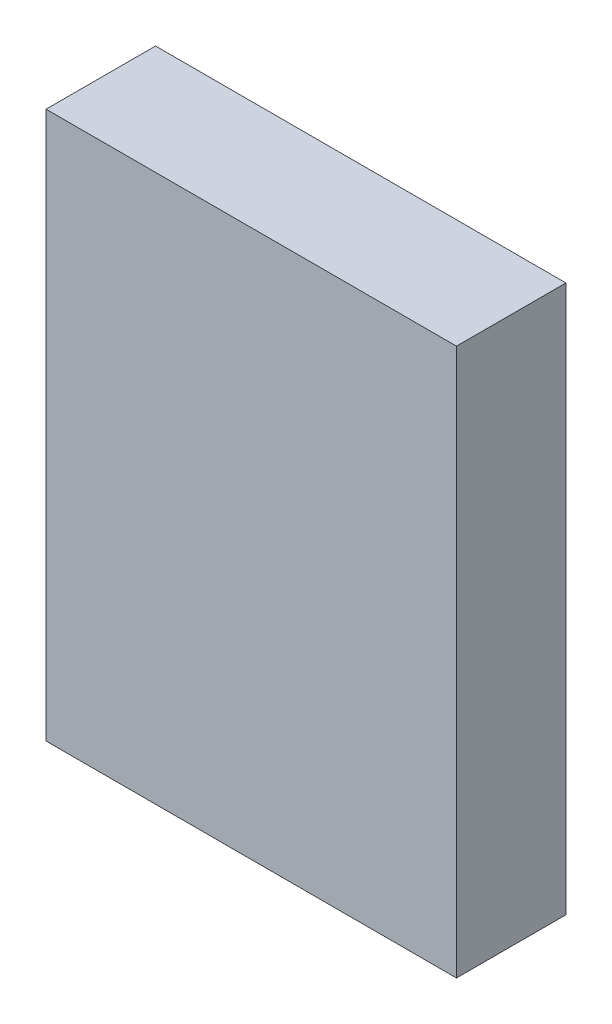
ISO-10303-21;
HEADER;
FILE_DESCRIPTION(('STEP AP214'),'2;1');
FILE_NAME('part.step','',(''),(''),'','','');
FILE_SCHEMA(('AUTOMOTIVE_DESIGN { 1 0 10303 214 1 1 1 1 }'));
ENDSEC;
DATA;
#1=APPLICATION_CONTEXT('core data for automotive mechanical design processes');
#2=APPLICATION_PROTOCOL_DEFINITION('international standard','automotive_design',2000,#1);
#3=PRODUCT_CONTEXT('',#1,'mechanical');
#4=PRODUCT('Part','Part','',(#3));
#5=PRODUCT_RELATED_PRODUCT_CATEGORY('part','',(#4));
#6=PRODUCT_DEFINITION_FORMATION('','',#4);
#7=PRODUCT_DEFINITION_CONTEXT('part definition',#1,'design');
#8=PRODUCT_DEFINITION('design','',#6,#7);
#9=PRODUCT_DEFINITION_SHAPE('','',#8);
#10=(LENGTH_UNIT() NAMED_UNIT(*) SI_UNIT(.MILLI.,.METRE.));
#11=(NAMED_UNIT(*) PLANE_ANGLE_UNIT() SI_UNIT($,.RADIAN.));
#12=(NAMED_UNIT(*) SI_UNIT($,.STERADIAN.) SOLID_ANGLE_UNIT());
#13=UNCERTAINTY_MEASURE_WITH_UNIT(LENGTH_MEASURE(1.E-05),#10,'distance_accuracy_value','');
#14=(GEOMETRIC_REPRESENTATION_CONTEXT(3) GLOBAL_UNCERTAINTY_ASSIGNED_CONTEXT((#13)) GLOBAL_UNIT_ASSIGNED_CONTEXT((#10,
#11,#12)) REPRESENTATION_CONTEXT('',''));
#15=CARTESIAN_POINT('',(0.,0.,0.));
#16=DIRECTION('',(0.,0.,1.));
#17=DIRECTION('',(1.,0.,0.));
#18=AXIS2_PLACEMENT_3D('',#15,#16,#17);
#19=CARTESIAN_POINT('',(0.,0.,6.));
#20=DIRECTION('',(1.,0.,0.));
#21=DIRECTION('',(0.,0.,-1.));
#22=AXIS2_PLACEMENT_3D('',#19,#20,#21);
#23=PLANE('',#22);
#24=DIRECTION('',(0.,-1.,0.));
#25=VECTOR('',#24,1.);
#26=CARTESIAN_POINT('',(0.,0.,0.));
#27=LINE('',#26,#25);
#28=CARTESIAN_POINT('',(0.,30.,0.));
#29=VERTEX_POINT('',#28);
#30=CARTESIAN_POINT('',(0.,0.,0.));
#31=VERTEX_POINT('',#30);
#32=EDGE_CURVE('E107',#29,#31,#27,.T.);
#33=ORIENTED_EDGE('',*,*,#32,.T.);
#34=DIRECTION('',(0.,0.,-1.));
#35=VECTOR('',#34,1.);
#36=CARTESIAN_POINT('',(0.,0.,6.));
#37=LINE('',#36,#35);
#38=CARTESIAN_POINT('',(0.,0.,6.));
#39=VERTEX_POINT('',#38);
#40=EDGE_CURVE('E11',#39,#31,#37,.T.);
#41=ORIENTED_EDGE('',*,*,#40,.F.);
#42=DIRECTION('',(0.,-1.,0.));
#43=VECTOR('',#42,1.);
#44=CARTESIAN_POINT('',(0.,0.,6.));
#45=LINE('',#44,#43);
#46=CARTESIAN_POINT('',(0.,30.,6.));
#47=VERTEX_POINT('',#46);
#48=EDGE_CURVE('E91',#47,#39,#45,.T.);
#49=ORIENTED_EDGE('',*,*,#48,.F.);
#50=DIRECTION('',(0.,0.,-1.));
#51=VECTOR('',#50,1.);
#52=CARTESIAN_POINT('',(0.,30.,6.));
#53=LINE('',#52,#51);
#54=EDGE_CURVE('E103',#47,#29,#53,.T.);
#55=ORIENTED_EDGE('',*,*,#54,.T.);
#56=EDGE_LOOP('',(#33,#41,#49,#55));
#57=FACE_BOUND('',#56,.T.);
#58=ADVANCED_FACE('F39',(#57),#23,.F.);
#59=CARTESIAN_POINT('',(0.,0.,6.));
#60=DIRECTION('',(0.,1.,0.));
#61=DIRECTION('',(0.,0.,1.));
#62=AXIS2_PLACEMENT_3D('',#59,#60,#61);
#63=PLANE('',#62);
#64=DIRECTION('',(1.,0.,0.));
#65=VECTOR('',#64,1.);
#66=CARTESIAN_POINT('',(0.,0.,0.));
#67=LINE('',#66,#65);
#68=CARTESIAN_POINT('',(22.5,0.,0.));
#69=VERTEX_POINT('',#68);
#70=EDGE_CURVE('E96',#31,#69,#67,.T.);
#71=ORIENTED_EDGE('',*,*,#70,.T.);
#72=DIRECTION('',(0.,0.,-1.));
#73=VECTOR('',#72,1.);
#74=CARTESIAN_POINT('',(22.5,0.,6.));
#75=LINE('',#74,#73);
#76=CARTESIAN_POINT('',(22.5,0.,6.));
#77=VERTEX_POINT('',#76);
#78=EDGE_CURVE('E48',#77,#69,#75,.T.);
#79=ORIENTED_EDGE('',*,*,#78,.F.);
#80=DIRECTION('',(1.,0.,0.));
#81=VECTOR('',#80,1.);
#82=CARTESIAN_POINT('',(0.,0.,6.));
#83=LINE('',#82,#81);
#84=EDGE_CURVE('E86',#39,#77,#83,.T.);
#85=ORIENTED_EDGE('',*,*,#84,.F.);
#86=ORIENTED_EDGE('',*,*,#40,.T.);
#87=EDGE_LOOP('',(#71,#79,#85,#86));
#88=FACE_BOUND('',#87,.T.);
#89=ADVANCED_FACE('F95',(#88),#63,.F.);
#90=CARTESIAN_POINT('',(22.5,0.,6.));
#91=DIRECTION('',(-1.,0.,0.));
#92=DIRECTION('',(0.,0.,1.));
#93=AXIS2_PLACEMENT_3D('',#90,#91,#92);
#94=PLANE('',#93);
#95=DIRECTION('',(0.,1.,0.));
#96=VECTOR('',#95,1.);
#97=CARTESIAN_POINT('',(22.5,0.,0.));
#98=LINE('',#97,#96);
#99=CARTESIAN_POINT('',(22.5,30.,0.));
#100=VERTEX_POINT('',#99);
#101=EDGE_CURVE('E73',#69,#100,#98,.T.);
#102=ORIENTED_EDGE('',*,*,#101,.T.);
#103=DIRECTION('',(0.,0.,-1.));
#104=VECTOR('',#103,1.);
#105=CARTESIAN_POINT('',(22.5,30.,6.));
#106=LINE('',#105,#104);
#107=CARTESIAN_POINT('',(22.5,30.,6.));
#108=VERTEX_POINT('',#107);
#109=EDGE_CURVE('E98',#108,#100,#106,.T.);
#110=ORIENTED_EDGE('',*,*,#109,.F.);
#111=DIRECTION('',(0.,1.,0.));
#112=VECTOR('',#111,1.);
#113=CARTESIAN_POINT('',(22.5,0.,6.));
#114=LINE('',#113,#112);
#115=EDGE_CURVE('E89',#77,#108,#114,.T.);
#116=ORIENTED_EDGE('',*,*,#115,.F.);
#117=ORIENTED_EDGE('',*,*,#78,.T.);
#118=EDGE_LOOP('',(#102,#110,#116,#117));
#119=FACE_BOUND('',#118,.T.);
#120=ADVANCED_FACE('F99',(#119),#94,.F.);
#121=CARTESIAN_POINT('',(0.,30.,6.));
#122=DIRECTION('',(0.,-1.,0.));
#123=DIRECTION('',(0.,0.,-1.));
#124=AXIS2_PLACEMENT_3D('',#121,#122,#123);
#125=PLANE('',#124);
#126=DIRECTION('',(-1.,0.,0.));
#127=VECTOR('',#126,1.);
#128=CARTESIAN_POINT('',(0.,30.,0.));
#129=LINE('',#128,#127);
#130=EDGE_CURVE('E79',#100,#29,#129,.T.);
#131=ORIENTED_EDGE('',*,*,#130,.T.);
#132=ORIENTED_EDGE('',*,*,#54,.F.);
#133=DIRECTION('',(-1.,0.,0.));
#134=VECTOR('',#133,1.);
#135=CARTESIAN_POINT('',(0.,30.,6.));
#136=LINE('',#135,#134);
#137=EDGE_CURVE('E56',#108,#47,#136,.T.);
#138=ORIENTED_EDGE('',*,*,#137,.F.);
#139=ORIENTED_EDGE('',*,*,#109,.T.);
#140=EDGE_LOOP('',(#131,#132,#138,#139));
#141=FACE_BOUND('',#140,.T.);
#142=ADVANCED_FACE('F120',(#141),#125,.F.);
#143=CARTESIAN_POINT('',(0.,0.,6.));
#144=DIRECTION('',(0.,0.,-1.));
#145=DIRECTION('',(-1.,0.,0.));
#146=AXIS2_PLACEMENT_3D('',#143,#144,#145);
#147=PLANE('',#146);
#148=ORIENTED_EDGE('',*,*,#48,.T.);
#149=ORIENTED_EDGE('',*,*,#84,.T.);
#150=ORIENTED_EDGE('',*,*,#115,.T.);
#151=ORIENTED_EDGE('',*,*,#137,.T.);
#152=EDGE_LOOP('',(#148,#149,#150,#151));
#153=FACE_BOUND('',#152,.T.);
#154=ADVANCED_FACE('F87',(#153),#147,.F.);
#155=CARTESIAN_POINT('',(0.,0.,0.));
#156=DIRECTION('',(0.,0.,-1.));
#157=DIRECTION('',(-1.,0.,0.));
#158=AXIS2_PLACEMENT_3D('',#155,#156,#157);
#159=PLANE('',#158);
#160=ORIENTED_EDGE('',*,*,#32,.F.);
#161=ORIENTED_EDGE('',*,*,#130,.F.);
#162=ORIENTED_EDGE('',*,*,#101,.F.);
#163=ORIENTED_EDGE('',*,*,#70,.F.);
#164=EDGE_LOOP('',(#160,#161,#162,#163));
#165=FACE_BOUND('',#164,.T.);
#166=ADVANCED_FACE('F123',(#165),#159,.T.);
#167=CLOSED_SHELL('',(#58,#89,#120,#142,#154,#166));
#168=MANIFOLD_SOLID_BREP('B2',#167);
#169=ADVANCED_BREP_SHAPE_REPRESENTATION('',(#18,#168),#14);
#170=SHAPE_DEFINITION_REPRESENTATION(#9,#169);
ENDSEC;
END-ISO-10303-21;
